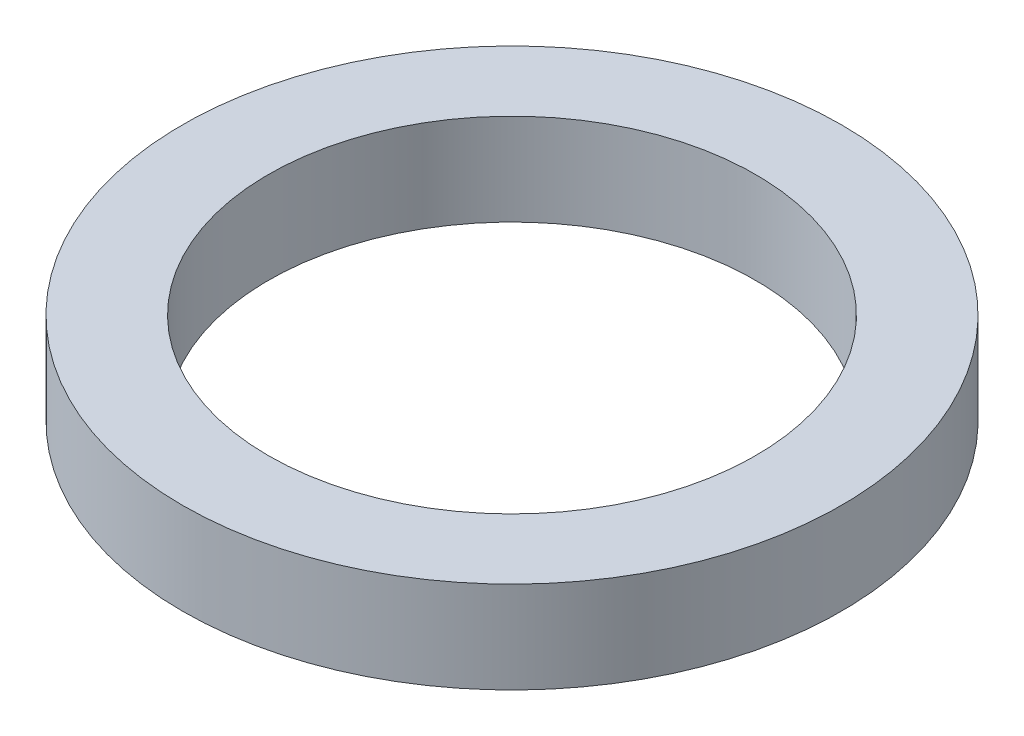
ISO-10303-21;
HEADER;
FILE_DESCRIPTION(('STEP AP214'),'2;1');
FILE_NAME('part.step','',(''),(''),'','','');
FILE_SCHEMA(('AUTOMOTIVE_DESIGN { 1 0 10303 214 1 1 1 1 }'));
ENDSEC;
DATA;
#1=APPLICATION_CONTEXT('core data for automotive mechanical design processes');
#2=APPLICATION_PROTOCOL_DEFINITION('international standard','automotive_design',2000,#1);
#3=PRODUCT_CONTEXT('',#1,'mechanical');
#4=PRODUCT('Part','Part','',(#3));
#5=PRODUCT_RELATED_PRODUCT_CATEGORY('part','',(#4));
#6=PRODUCT_DEFINITION_FORMATION('','',#4);
#7=PRODUCT_DEFINITION_CONTEXT('part definition',#1,'design');
#8=PRODUCT_DEFINITION('design','',#6,#7);
#9=PRODUCT_DEFINITION_SHAPE('','',#8);
#10=(LENGTH_UNIT() NAMED_UNIT(*) SI_UNIT(.MILLI.,.METRE.));
#11=(NAMED_UNIT(*) PLANE_ANGLE_UNIT() SI_UNIT($,.RADIAN.));
#12=(NAMED_UNIT(*) SI_UNIT($,.STERADIAN.) SOLID_ANGLE_UNIT());
#13=UNCERTAINTY_MEASURE_WITH_UNIT(LENGTH_MEASURE(1.E-05),#10,'distance_accuracy_value','');
#14=(GEOMETRIC_REPRESENTATION_CONTEXT(3) GLOBAL_UNCERTAINTY_ASSIGNED_CONTEXT((#13)) GLOBAL_UNIT_ASSIGNED_CONTEXT((#10,
#11,#12)) REPRESENTATION_CONTEXT('',''));
#15=CARTESIAN_POINT('',(0.,0.,0.));
#16=DIRECTION('',(0.,0.,1.));
#17=DIRECTION('',(1.,0.,0.));
#18=AXIS2_PLACEMENT_3D('',#15,#16,#17);
#19=CARTESIAN_POINT('',(0.,16.,0.));
#20=DIRECTION('',(0.,-1.,0.));
#21=DIRECTION('',(0.,0.,-1.));
#22=AXIS2_PLACEMENT_3D('',#19,#20,#21);
#23=CYLINDRICAL_SURFACE('',#22,57.5);
#24=CARTESIAN_POINT('',(0.,16.,0.));
#25=DIRECTION('',(0.,1.,0.));
#26=DIRECTION('',(0.,0.,1.));
#27=AXIS2_PLACEMENT_3D('',#24,#25,#26);
#28=CIRCLE('',#27,57.5);
#29=CARTESIAN_POINT('',(0.,16.,57.5));
#30=VERTEX_POINT('',#29);
#31=EDGE_CURVE('E10',#30,#30,#28,.T.);
#32=ORIENTED_EDGE('',*,*,#31,.F.);
#33=EDGE_LOOP('',(#32));
#34=FACE_BOUND('',#33,.T.);
#35=CARTESIAN_POINT('',(0.,0.,0.));
#36=DIRECTION('',(0.,1.,0.));
#37=DIRECTION('',(0.,0.,1.));
#38=AXIS2_PLACEMENT_3D('',#35,#36,#37);
#39=CIRCLE('',#38,57.5);
#40=CARTESIAN_POINT('',(0.,0.,57.5));
#41=VERTEX_POINT('',#40);
#42=EDGE_CURVE('E37',#41,#41,#39,.T.);
#43=ORIENTED_EDGE('',*,*,#42,.T.);
#44=EDGE_LOOP('',(#43));
#45=FACE_BOUND('',#44,.T.);
#46=ADVANCED_FACE('F40',(#34,#45),#23,.T.);
#47=CARTESIAN_POINT('',(0.,16.,0.));
#48=DIRECTION('',(0.,1.,0.));
#49=DIRECTION('',(0.,0.,1.));
#50=AXIS2_PLACEMENT_3D('',#47,#48,#49);
#51=PLANE('',#50);
#52=CARTESIAN_POINT('',(0.,16.,0.));
#53=DIRECTION('',(0.,1.,0.));
#54=DIRECTION('',(0.,0.,1.));
#55=AXIS2_PLACEMENT_3D('',#52,#53,#54);
#56=CIRCLE('',#55,42.5);
#57=CARTESIAN_POINT('',(0.,16.,42.5));
#58=VERTEX_POINT('',#57);
#59=EDGE_CURVE('E50',#58,#58,#56,.T.);
#60=ORIENTED_EDGE('',*,*,#59,.F.);
#61=EDGE_LOOP('',(#60));
#62=FACE_BOUND('',#61,.T.);
#63=ORIENTED_EDGE('',*,*,#31,.T.);
#64=EDGE_LOOP('',(#63));
#65=FACE_BOUND('',#64,.T.);
#66=ADVANCED_FACE('F59',(#62,#65),#51,.T.);
#67=CARTESIAN_POINT('',(0.,0.,0.));
#68=DIRECTION('',(0.,1.,0.));
#69=DIRECTION('',(0.,0.,1.));
#70=AXIS2_PLACEMENT_3D('',#67,#68,#69);
#71=PLANE('',#70);
#72=CARTESIAN_POINT('',(0.,0.,0.));
#73=DIRECTION('',(0.,1.,0.));
#74=DIRECTION('',(0.,0.,1.));
#75=AXIS2_PLACEMENT_3D('',#72,#73,#74);
#76=CIRCLE('',#75,42.5);
#77=CARTESIAN_POINT('',(0.,0.,42.5));
#78=VERTEX_POINT('',#77);
#79=EDGE_CURVE('E47',#78,#78,#76,.T.);
#80=ORIENTED_EDGE('',*,*,#79,.T.);
#81=EDGE_LOOP('',(#80));
#82=FACE_BOUND('',#81,.T.);
#83=ORIENTED_EDGE('',*,*,#42,.F.);
#84=EDGE_LOOP('',(#83));
#85=FACE_BOUND('',#84,.T.);
#86=ADVANCED_FACE('F58',(#82,#85),#71,.F.);
#87=CARTESIAN_POINT('',(0.,16.,0.));
#88=DIRECTION('',(0.,-1.,0.));
#89=DIRECTION('',(0.,0.,-1.));
#90=AXIS2_PLACEMENT_3D('',#87,#88,#89);
#91=CYLINDRICAL_SURFACE('',#90,42.5);
#92=ORIENTED_EDGE('',*,*,#59,.T.);
#93=EDGE_LOOP('',(#92));
#94=FACE_BOUND('',#93,.T.);
#95=ORIENTED_EDGE('',*,*,#79,.F.);
#96=EDGE_LOOP('',(#95));
#97=FACE_BOUND('',#96,.T.);
#98=ADVANCED_FACE('F54',(#94,#97),#91,.F.);
#99=CLOSED_SHELL('',(#46,#66,#86,#98));
#100=MANIFOLD_SOLID_BREP('B2',#99);
#101=ADVANCED_BREP_SHAPE_REPRESENTATION('',(#18,#100),#14);
#102=SHAPE_DEFINITION_REPRESENTATION(#9,#101);
ENDSEC;
END-ISO-10303-21;
